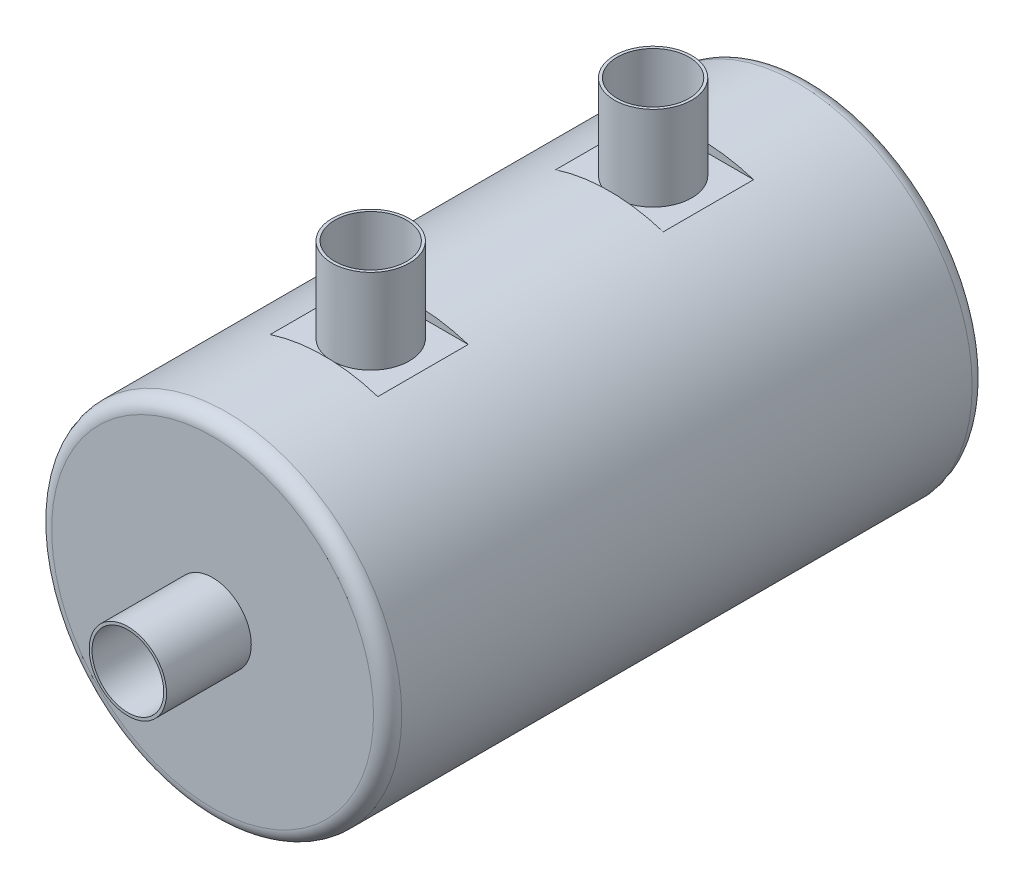
ISO-10303-21;
HEADER;
FILE_DESCRIPTION(('STEP AP214'),'2;1');
FILE_NAME('part.step','',(''),(''),'','','');
FILE_SCHEMA(('AUTOMOTIVE_DESIGN { 1 0 10303 214 1 1 1 1 }'));
ENDSEC;
DATA;
#1=APPLICATION_CONTEXT('core data for automotive mechanical design processes');
#2=APPLICATION_PROTOCOL_DEFINITION('international standard','automotive_design',2000,#1);
#3=PRODUCT_CONTEXT('',#1,'mechanical');
#4=PRODUCT('Part','Part','',(#3));
#5=PRODUCT_RELATED_PRODUCT_CATEGORY('part','',(#4));
#6=PRODUCT_DEFINITION_FORMATION('','',#4);
#7=PRODUCT_DEFINITION_CONTEXT('part definition',#1,'design');
#8=PRODUCT_DEFINITION('design','',#6,#7);
#9=PRODUCT_DEFINITION_SHAPE('','',#8);
#10=(LENGTH_UNIT() NAMED_UNIT(*) SI_UNIT(.MILLI.,.METRE.));
#11=(NAMED_UNIT(*) PLANE_ANGLE_UNIT() SI_UNIT($,.RADIAN.));
#12=(NAMED_UNIT(*) SI_UNIT($,.STERADIAN.) SOLID_ANGLE_UNIT());
#13=UNCERTAINTY_MEASURE_WITH_UNIT(LENGTH_MEASURE(1.E-05),#10,'distance_accuracy_value','');
#14=(GEOMETRIC_REPRESENTATION_CONTEXT(3) GLOBAL_UNCERTAINTY_ASSIGNED_CONTEXT((#13)) GLOBAL_UNIT_ASSIGNED_CONTEXT((#10,
#11,#12)) REPRESENTATION_CONTEXT('',''));
#15=CARTESIAN_POINT('',(0.,0.,0.));
#16=DIRECTION('',(0.,0.,1.));
#17=DIRECTION('',(1.,0.,0.));
#18=AXIS2_PLACEMENT_3D('',#15,#16,#17);
#19=CARTESIAN_POINT('',(0.,0.,-100.));
#20=DIRECTION('',(0.,0.,1.));
#21=DIRECTION('',(1.,0.,0.));
#22=AXIS2_PLACEMENT_3D('',#19,#20,#21);
#23=CYLINDRICAL_SURFACE('',#22,31.);
#24=CARTESIAN_POINT('',(0.,0.,-100.5));
#25=DIRECTION('',(0.,0.,-1.));
#26=DIRECTION('',(-1.,0.,0.));
#27=AXIS2_PLACEMENT_3D('',#24,#25,#26);
#28=CIRCLE('',#27,31.);
#29=CARTESIAN_POINT('',(-31.,0.,-100.5));
#30=VERTEX_POINT('',#29);
#31=EDGE_CURVE('E43',#30,#30,#28,.F.);
#32=ORIENTED_EDGE('',*,*,#31,.T.);
#33=EDGE_LOOP('',(#32));
#34=FACE_BOUND('',#33,.T.);
#35=CARTESIAN_POINT('',(0.,0.,0.5));
#36=DIRECTION('',(0.,0.,1.));
#37=DIRECTION('',(1.,0.,0.));
#38=AXIS2_PLACEMENT_3D('',#35,#36,#37);
#39=CIRCLE('',#38,31.);
#40=CARTESIAN_POINT('',(31.,0.,0.5));
#41=VERTEX_POINT('',#40);
#42=EDGE_CURVE('E236',#41,#41,#39,.F.);
#43=ORIENTED_EDGE('',*,*,#42,.T.);
#44=EDGE_LOOP('',(#43));
#45=FACE_BOUND('',#44,.T.);
#46=DIRECTION('',(0.,0.,1.));
#47=VECTOR('',#46,1.);
#48=CARTESIAN_POINT('',(-9.52627944162889,29.5,-100.));
#49=LINE('',#48,#47);
#50=CARTESIAN_POINT('',(-9.52627944162889,29.5,-32.7300887283543));
#51=VERTEX_POINT('',#50);
#52=CARTESIAN_POINT('',(-9.52627944162884,29.5,-16.7300887283543));
#53=VERTEX_POINT('',#52);
#54=EDGE_CURVE('E81',#51,#53,#49,.T.);
#55=ORIENTED_EDGE('',*,*,#54,.F.);
#56=CARTESIAN_POINT('',(0.,0.,-32.7300887283543));
#57=DIRECTION('',(0.,0.,1.));
#58=DIRECTION('',(1.,0.,0.));
#59=AXIS2_PLACEMENT_3D('',#56,#57,#58);
#60=CIRCLE('',#59,31.);
#61=CARTESIAN_POINT('',(9.52627944162889,29.5,-32.7300887283543));
#62=VERTEX_POINT('',#61);
#63=EDGE_CURVE('E112',#51,#62,#60,.F.);
#64=ORIENTED_EDGE('',*,*,#63,.T.);
#65=DIRECTION('',(0.,0.,1.));
#66=VECTOR('',#65,1.);
#67=CARTESIAN_POINT('',(9.52627944162889,29.5,-100.));
#68=LINE('',#67,#66);
#69=CARTESIAN_POINT('',(9.52627944162884,29.5,-16.7300887283543));
#70=VERTEX_POINT('',#69);
#71=EDGE_CURVE('E82',#70,#62,#68,.F.);
#72=ORIENTED_EDGE('',*,*,#71,.F.);
#73=CARTESIAN_POINT('',(0.,0.,-16.7300887283543));
#74=DIRECTION('',(0.,0.,1.));
#75=DIRECTION('',(1.,0.,0.));
#76=AXIS2_PLACEMENT_3D('',#73,#74,#75);
#77=CIRCLE('',#76,31.);
#78=EDGE_CURVE('E77',#53,#70,#77,.F.);
#79=ORIENTED_EDGE('',*,*,#78,.F.);
#80=EDGE_LOOP('',(#55,#64,#72,#79));
#81=FACE_BOUND('',#80,.T.);
#82=DIRECTION('',(0.,0.,1.));
#83=VECTOR('',#82,1.);
#84=CARTESIAN_POINT('',(-9.52627944162883,29.5,-100.));
#85=LINE('',#84,#83);
#86=CARTESIAN_POINT('',(-9.52627944162885,29.5,-67.2699112716457));
#87=VERTEX_POINT('',#86);
#88=CARTESIAN_POINT('',(-9.52627944162883,29.5,-83.2699112716457));
#89=VERTEX_POINT('',#88);
#90=EDGE_CURVE('E117',#87,#89,#85,.F.);
#91=ORIENTED_EDGE('',*,*,#90,.T.);
#92=CARTESIAN_POINT('',(0.,0.,-83.2699112716457));
#93=DIRECTION('',(0.,0.,1.));
#94=DIRECTION('',(1.,0.,0.));
#95=AXIS2_PLACEMENT_3D('',#92,#93,#94);
#96=CIRCLE('',#95,31.);
#97=CARTESIAN_POINT('',(9.52627944162883,29.5,-83.2699112716457));
#98=VERTEX_POINT('',#97);
#99=EDGE_CURVE('E56',#89,#98,#96,.F.);
#100=ORIENTED_EDGE('',*,*,#99,.T.);
#101=DIRECTION('',(0.,0.,1.));
#102=VECTOR('',#101,1.);
#103=CARTESIAN_POINT('',(9.52627944162883,29.5,-100.));
#104=LINE('',#103,#102);
#105=CARTESIAN_POINT('',(9.52627944162885,29.5,-67.2699112716457));
#106=VERTEX_POINT('',#105);
#107=EDGE_CURVE('E50',#98,#106,#104,.T.);
#108=ORIENTED_EDGE('',*,*,#107,.T.);
#109=CARTESIAN_POINT('',(0.,0.,-67.2699112716457));
#110=DIRECTION('',(0.,0.,1.));
#111=DIRECTION('',(1.,0.,0.));
#112=AXIS2_PLACEMENT_3D('',#109,#110,#111);
#113=CIRCLE('',#112,31.);
#114=EDGE_CURVE('E114',#87,#106,#113,.F.);
#115=ORIENTED_EDGE('',*,*,#114,.F.);
#116=EDGE_LOOP('',(#91,#100,#108,#115));
#117=FACE_BOUND('',#116,.T.);
#118=ADVANCED_FACE('F35',(#34,#45,#81,#117),#23,.T.);
#119=CARTESIAN_POINT('',(0.,0.,3.));
#120=DIRECTION('',(0.,0.,1.));
#121=DIRECTION('',(1.,0.,0.));
#122=AXIS2_PLACEMENT_3D('',#119,#120,#121);
#123=PLANE('',#122);
#124=CARTESIAN_POINT('',(0.,0.,3.));
#125=DIRECTION('',(0.,0.,1.));
#126=DIRECTION('',(1.,0.,0.));
#127=AXIS2_PLACEMENT_3D('',#124,#125,#126);
#128=CIRCLE('',#127,28.5);
#129=CARTESIAN_POINT('',(28.5,0.,3.));
#130=VERTEX_POINT('',#129);
#131=EDGE_CURVE('E11',#130,#130,#128,.T.);
#132=ORIENTED_EDGE('',*,*,#131,.T.);
#133=EDGE_LOOP('',(#132));
#134=FACE_BOUND('',#133,.T.);
#135=CARTESIAN_POINT('',(0.,0.,3.));
#136=DIRECTION('',(0.,0.,1.));
#137=DIRECTION('',(1.,0.,0.));
#138=AXIS2_PLACEMENT_3D('',#135,#136,#137);
#139=CIRCLE('',#138,6.85);
#140=CARTESIAN_POINT('',(6.85,0.,3.));
#141=VERTEX_POINT('',#140);
#142=EDGE_CURVE('E251',#141,#141,#139,.T.);
#143=ORIENTED_EDGE('',*,*,#142,.F.);
#144=EDGE_LOOP('',(#143));
#145=FACE_BOUND('',#144,.T.);
#146=ADVANCED_FACE('F196',(#134,#145),#123,.T.);
#147=CARTESIAN_POINT('',(0.,0.,-103.));
#148=DIRECTION('',(0.,0.,-1.));
#149=DIRECTION('',(-1.,0.,0.));
#150=AXIS2_PLACEMENT_3D('',#147,#148,#149);
#151=PLANE('',#150);
#152=CARTESIAN_POINT('',(0.,0.,-103.));
#153=DIRECTION('',(0.,0.,-1.));
#154=DIRECTION('',(-1.,0.,0.));
#155=AXIS2_PLACEMENT_3D('',#152,#153,#154);
#156=CIRCLE('',#155,28.5);
#157=CARTESIAN_POINT('',(-28.5,0.,-103.));
#158=VERTEX_POINT('',#157);
#159=EDGE_CURVE('E235',#158,#158,#156,.T.);
#160=ORIENTED_EDGE('',*,*,#159,.T.);
#161=EDGE_LOOP('',(#160));
#162=FACE_BOUND('',#161,.T.);
#163=CARTESIAN_POINT('',(0.,0.,-103.));
#164=DIRECTION('',(0.,0.,-1.));
#165=DIRECTION('',(-1.,0.,0.));
#166=AXIS2_PLACEMENT_3D('',#163,#164,#165);
#167=CIRCLE('',#166,6.85);
#168=CARTESIAN_POINT('',(-6.85,0.,-103.));
#169=VERTEX_POINT('',#168);
#170=EDGE_CURVE('E124',#169,#169,#167,.T.);
#171=ORIENTED_EDGE('',*,*,#170,.F.);
#172=EDGE_LOOP('',(#171));
#173=FACE_BOUND('',#172,.T.);
#174=ADVANCED_FACE('F187',(#162,#173),#151,.T.);
#175=CARTESIAN_POINT('',(-31.,0.,-32.7300887283543));
#176=DIRECTION('',(0.,0.,1.));
#177=DIRECTION('',(1.,0.,0.));
#178=AXIS2_PLACEMENT_3D('',#175,#176,#177);
#179=PLANE('',#178);
#180=DIRECTION('',(1.,0.,0.));
#181=VECTOR('',#180,1.);
#182=CARTESIAN_POINT('',(-31.,29.5,-32.7300887283543));
#183=LINE('',#182,#181);
#184=EDGE_CURVE('E93',#51,#62,#183,.T.);
#185=ORIENTED_EDGE('',*,*,#184,.T.);
#186=ORIENTED_EDGE('',*,*,#63,.F.);
#187=EDGE_LOOP('',(#185,#186));
#188=FACE_BOUND('',#187,.T.);
#189=ADVANCED_FACE('F184',(#188),#179,.T.);
#190=CARTESIAN_POINT('',(-31.,29.5,0.));
#191=DIRECTION('',(0.,-1.,0.));
#192=DIRECTION('',(0.,0.,-1.));
#193=AXIS2_PLACEMENT_3D('',#190,#191,#192);
#194=PLANE('',#193);
#195=CARTESIAN_POINT('',(0.,29.5,-25.));
#196=DIRECTION('',(0.,-1.,0.));
#197=DIRECTION('',(0.,0.,-1.));
#198=AXIS2_PLACEMENT_3D('',#195,#196,#197);
#199=CIRCLE('',#198,6.85);
#200=CARTESIAN_POINT('',(0.,29.5,-31.85));
#201=VERTEX_POINT('',#200);
#202=EDGE_CURVE('E121',#201,#201,#199,.F.);
#203=ORIENTED_EDGE('',*,*,#202,.F.);
#204=EDGE_LOOP('',(#203));
#205=FACE_BOUND('',#204,.T.);
#206=ORIENTED_EDGE('',*,*,#71,.T.);
#207=ORIENTED_EDGE('',*,*,#184,.F.);
#208=ORIENTED_EDGE('',*,*,#54,.T.);
#209=DIRECTION('',(1.,0.,0.));
#210=VECTOR('',#209,1.);
#211=CARTESIAN_POINT('',(-31.,29.5,-16.7300887283543));
#212=LINE('',#211,#210);
#213=EDGE_CURVE('E91',#53,#70,#212,.T.);
#214=ORIENTED_EDGE('',*,*,#213,.T.);
#215=EDGE_LOOP('',(#206,#207,#208,#214));
#216=FACE_BOUND('',#215,.T.);
#217=ADVANCED_FACE('F90',(#205,#216),#194,.F.);
#218=CARTESIAN_POINT('',(-31.,0.,-16.7300887283543));
#219=DIRECTION('',(0.,0.,1.));
#220=DIRECTION('',(1.,0.,0.));
#221=AXIS2_PLACEMENT_3D('',#218,#219,#220);
#222=PLANE('',#221);
#223=ORIENTED_EDGE('',*,*,#213,.F.);
#224=ORIENTED_EDGE('',*,*,#78,.T.);
#225=EDGE_LOOP('',(#223,#224));
#226=FACE_BOUND('',#225,.T.);
#227=ADVANCED_FACE('F95',(#226),#222,.F.);
#228=CARTESIAN_POINT('',(-31.,0.,-83.2699112716457));
#229=DIRECTION('',(0.,0.,1.));
#230=DIRECTION('',(1.,0.,0.));
#231=AXIS2_PLACEMENT_3D('',#228,#229,#230);
#232=PLANE('',#231);
#233=DIRECTION('',(1.,0.,0.));
#234=VECTOR('',#233,1.);
#235=CARTESIAN_POINT('',(-31.,29.5,-83.2699112716457));
#236=LINE('',#235,#234);
#237=EDGE_CURVE('E109',#89,#98,#236,.T.);
#238=ORIENTED_EDGE('',*,*,#237,.T.);
#239=ORIENTED_EDGE('',*,*,#99,.F.);
#240=EDGE_LOOP('',(#238,#239));
#241=FACE_BOUND('',#240,.T.);
#242=ADVANCED_FACE('F174',(#241),#232,.T.);
#243=CARTESIAN_POINT('',(-31.,29.5,0.));
#244=DIRECTION('',(0.,1.,0.));
#245=DIRECTION('',(0.,0.,1.));
#246=AXIS2_PLACEMENT_3D('',#243,#244,#245);
#247=PLANE('',#246);
#248=CARTESIAN_POINT('',(0.,29.5,-75.));
#249=DIRECTION('',(0.,1.,0.));
#250=DIRECTION('',(0.,0.,1.));
#251=AXIS2_PLACEMENT_3D('',#248,#249,#250);
#252=CIRCLE('',#251,6.85);
#253=CARTESIAN_POINT('',(0.,29.5,-68.15));
#254=VERTEX_POINT('',#253);
#255=EDGE_CURVE('E267',#254,#254,#252,.T.);
#256=ORIENTED_EDGE('',*,*,#255,.F.);
#257=EDGE_LOOP('',(#256));
#258=FACE_BOUND('',#257,.T.);
#259=DIRECTION('',(1.,0.,0.));
#260=VECTOR('',#259,1.);
#261=CARTESIAN_POINT('',(-31.,29.5,-67.2699112716457));
#262=LINE('',#261,#260);
#263=EDGE_CURVE('E98',#87,#106,#262,.T.);
#264=ORIENTED_EDGE('',*,*,#263,.T.);
#265=ORIENTED_EDGE('',*,*,#107,.F.);
#266=ORIENTED_EDGE('',*,*,#237,.F.);
#267=ORIENTED_EDGE('',*,*,#90,.F.);
#268=EDGE_LOOP('',(#264,#265,#266,#267));
#269=FACE_BOUND('',#268,.T.);
#270=ADVANCED_FACE('F177',(#258,#269),#247,.T.);
#271=CARTESIAN_POINT('',(-31.,0.,-67.2699112716457));
#272=DIRECTION('',(0.,0.,1.));
#273=DIRECTION('',(1.,0.,0.));
#274=AXIS2_PLACEMENT_3D('',#271,#272,#273);
#275=PLANE('',#274);
#276=ORIENTED_EDGE('',*,*,#263,.F.);
#277=ORIENTED_EDGE('',*,*,#114,.T.);
#278=EDGE_LOOP('',(#276,#277));
#279=FACE_BOUND('',#278,.T.);
#280=ADVANCED_FACE('F169',(#279),#275,.F.);
#281=CARTESIAN_POINT('',(0.,44.5,-25.));
#282=DIRECTION('',(0.,1.,0.));
#283=DIRECTION('',(0.,0.,1.));
#284=AXIS2_PLACEMENT_3D('',#281,#282,#283);
#285=PLANE('',#284);
#286=CARTESIAN_POINT('',(0.,44.5,-25.));
#287=DIRECTION('',(0.,1.,0.));
#288=DIRECTION('',(0.,0.,1.));
#289=AXIS2_PLACEMENT_3D('',#286,#287,#288);
#290=CIRCLE('',#289,6.85);
#291=CARTESIAN_POINT('',(0.,44.5,-18.15));
#292=VERTEX_POINT('',#291);
#293=EDGE_CURVE('E96',#292,#292,#290,.T.);
#294=ORIENTED_EDGE('',*,*,#293,.T.);
#295=EDGE_LOOP('',(#294));
#296=FACE_BOUND('',#295,.T.);
#297=CARTESIAN_POINT('',(0.,44.5,-25.));
#298=DIRECTION('',(0.,1.,0.));
#299=DIRECTION('',(0.,0.,1.));
#300=AXIS2_PLACEMENT_3D('',#297,#298,#299);
#301=CIRCLE('',#300,6.35);
#302=CARTESIAN_POINT('',(0.,44.5,-18.65));
#303=VERTEX_POINT('',#302);
#304=EDGE_CURVE('E101',#303,#303,#301,.T.);
#305=ORIENTED_EDGE('',*,*,#304,.F.);
#306=EDGE_LOOP('',(#305));
#307=FACE_BOUND('',#306,.T.);
#308=ADVANCED_FACE('F166',(#296,#307),#285,.T.);
#309=CARTESIAN_POINT('',(0.,44.5,-25.));
#310=DIRECTION('',(0.,-1.,0.));
#311=DIRECTION('',(0.,0.,-1.));
#312=AXIS2_PLACEMENT_3D('',#309,#310,#311);
#313=CYLINDRICAL_SURFACE('',#312,6.85);
#314=ORIENTED_EDGE('',*,*,#293,.F.);
#315=EDGE_LOOP('',(#314));
#316=FACE_BOUND('',#315,.T.);
#317=ORIENTED_EDGE('',*,*,#202,.T.);
#318=EDGE_LOOP('',(#317));
#319=FACE_BOUND('',#318,.T.);
#320=ADVANCED_FACE('F164',(#316,#319),#313,.T.);
#321=CARTESIAN_POINT('',(0.,44.5,-25.));
#322=DIRECTION('',(0.,-1.,0.));
#323=DIRECTION('',(0.,0.,-1.));
#324=AXIS2_PLACEMENT_3D('',#321,#322,#323);
#325=CYLINDRICAL_SURFACE('',#324,6.35);
#326=ORIENTED_EDGE('',*,*,#304,.T.);
#327=EDGE_LOOP('',(#326));
#328=FACE_BOUND('',#327,.T.);
#329=CARTESIAN_POINT('',(0.,28.,-18.65));
#330=CARTESIAN_POINT('',(0.175986127385621,28.0000024424553,-18.6499956540871));
#331=CARTESIAN_POINT('',(0.351921493153296,27.9983381630356,-18.6573175071976));
#332=CARTESIAN_POINT('',(0.702567132027708,27.9917328650277,-18.6865356173294));
#333=CARTESIAN_POINT('',(0.877277228705688,27.9867913839566,-18.7084339314016));
#334=CARTESIAN_POINT('',(1.22422588288912,27.9737633373598,-18.7666435265278));
#335=CARTESIAN_POINT('',(1.39646339404666,27.9656754787984,-18.8029607332989));
#336=CARTESIAN_POINT('',(1.73724262106718,27.9465761894508,-18.8897289751157));
#337=CARTESIAN_POINT('',(1.90578295194551,27.9355636826589,-18.9401852124221));
#338=CARTESIAN_POINT('',(2.23768148687968,27.9109375729308,-19.054744920799));
#339=CARTESIAN_POINT('',(2.401046958007,27.8973278250143,-19.1188281815325));
#340=CARTESIAN_POINT('',(2.72180725449148,27.8678617176012,-19.2602267311709));
#341=CARTESIAN_POINT('',(2.87919985053269,27.8520045295247,-19.3375469024181));
#342=CARTESIAN_POINT('',(3.18684430174427,27.8184823405264,-19.5048051219872));
#343=CARTESIAN_POINT('',(3.3370990089661,27.8008180707013,-19.5947380729372));
#344=CARTESIAN_POINT('',(3.62961307002988,27.7641432162039,-19.7866498325685));
#345=CARTESIAN_POINT('',(3.77186939882862,27.7451321282178,-19.8886331541555));
#346=CARTESIAN_POINT('',(4.04948558874383,27.7059851790748,-20.1055478860974));
#347=CARTESIAN_POINT('',(4.18470959091231,27.6858367037728,-20.2206509293078));
#348=CARTESIAN_POINT('',(4.44507131624075,27.6452294480879,-20.4617913703419));
#349=CARTESIAN_POINT('',(4.57020528059963,27.6247705554079,-20.5878328070291));
#350=CARTESIAN_POINT('',(4.80946697940778,27.5841213764205,-20.8499391945167));
#351=CARTESIAN_POINT('',(4.92359769365625,27.5639310186749,-20.986001413875));
#352=CARTESIAN_POINT('',(5.14015753337279,27.5243692885291,-21.2673328042956));
#353=CARTESIAN_POINT('',(5.24258232593044,27.504998221047,-21.4126053537982));
#354=CARTESIAN_POINT('',(5.43608669423084,27.4674133086096,-21.7130923443561));
#355=CARTESIAN_POINT('',(5.52702047529137,27.449215541772,-21.8684027586552));
#356=CARTESIAN_POINT('',(5.69548844081909,27.4147552736178,-22.1864064421749));
#357=CARTESIAN_POINT('',(5.77301757761592,27.3984935020368,-22.3491024635391));
#358=CARTESIAN_POINT('',(5.91400279612861,27.3684085006424,-22.6806304593824));
#359=CARTESIAN_POINT('',(5.97746551452543,27.3545841214746,-22.8494594962919));
#360=CARTESIAN_POINT('',(6.08987173319902,27.3297771869963,-23.1920847683122));
#361=CARTESIAN_POINT('',(6.13880999967146,27.3187956562718,-23.3658827692887));
#362=CARTESIAN_POINT('',(6.26172437814057,27.2909915422141,-23.8869933853279));
#363=CARTESIAN_POINT('',(6.31432610465363,27.2787505168291,-24.2399879893103));
#364=CARTESIAN_POINT('',(6.34840572928265,27.2708210488766,-24.771904554236));
#365=CARTESIAN_POINT('',(6.35228778451299,27.2699182764588,-24.9496848146028));
#366=CARTESIAN_POINT('',(6.34515920453633,27.2715782189895,-25.3049521026713));
#367=CARTESIAN_POINT('',(6.33414838144853,27.2741409776575,-25.4824391266455));
#368=CARTESIAN_POINT('',(6.27953964071084,27.2867929015038,-26.0054165707217));
#369=CARTESIAN_POINT('',(6.21481915445443,27.3017425123797,-26.3488210164901));
#370=CARTESIAN_POINT('',(6.03033647048368,27.3430757570479,-27.0195856905308));
#371=CARTESIAN_POINT('',(5.91057097783838,27.3694600753033,-27.3469449570588));
#372=CARTESIAN_POINT('',(5.61835125411965,27.4309409473964,-27.9797763488862));
#373=CARTESIAN_POINT('',(5.44545800500307,27.4661096190853,-28.2850388810494));
#374=CARTESIAN_POINT('',(5.05219952171485,27.5411552326439,-28.8626311218642));
#375=CARTESIAN_POINT('',(4.83182735910084,27.5810328612921,-29.1349560149686));
#376=CARTESIAN_POINT('',(4.34376958149265,27.6621427074177,-29.6456183164627));
#377=CARTESIAN_POINT('',(4.07510117071894,27.7033848372386,-29.8830159359653));
#378=CARTESIAN_POINT('',(3.50129126676188,27.7817327859305,-30.3095439796522));
#379=CARTESIAN_POINT('',(3.1961490132693,27.8188385185458,-30.4986733974123));
#380=CARTESIAN_POINT('',(2.55685867746273,27.8848678435702,-30.8235570863196));
#381=CARTESIAN_POINT('',(2.22264213876643,27.9137714029154,-30.9591809847432));
#382=CARTESIAN_POINT('',(1.535359783775,27.9599918641085,-31.1720770524521));
#383=CARTESIAN_POINT('',(1.182296928438,27.9773105803075,-31.2493583592612));
#384=CARTESIAN_POINT('',(0.475399502808541,27.9981492228286,-31.3419918768677));
#385=CARTESIAN_POINT('',(0.121741236051884,28.0019549456653,-31.3586269466822));
#386=CARTESIAN_POINT('',(-0.58330156656709,27.9961428976034,-31.3329829615933));
#387=CARTESIAN_POINT('',(-0.934686266979755,27.9865261093339,-31.290708219333));
#388=CARTESIAN_POINT('',(-1.6209058084874,27.9551306729822,-31.1495074510628));
#389=CARTESIAN_POINT('',(-1.95588774450323,27.9334979785049,-31.0512609366414));
#390=CARTESIAN_POINT('',(-2.60461379091722,27.8804951216384,-30.8016638395594));
#391=CARTESIAN_POINT('',(-2.91835599833118,27.8491240881406,-30.6503085060794));
#392=CARTESIAN_POINT('',(-3.52095109644635,27.7794238710292,-30.2961681989962));
#393=CARTESIAN_POINT('',(-3.80935448924766,27.7409963995272,-30.0926382422524));
#394=CARTESIAN_POINT('',(-4.34837653218561,27.6616337243811,-29.6408824251491));
#395=CARTESIAN_POINT('',(-4.59898987129981,27.6206981693851,-29.392650293073));
#396=CARTESIAN_POINT('',(-5.06042541220889,27.539937451294,-28.8526967446296));
#397=CARTESIAN_POINT('',(-5.2703558673263,27.500150632096,-28.5602077498299));
#398=CARTESIAN_POINT('',(-5.63817419183463,27.4271101044796,-27.9431738296425));
#399=CARTESIAN_POINT('',(-5.79606435953263,27.3938561075719,-27.6186303207333));
#400=CARTESIAN_POINT('',(-5.98974613210324,27.3519135560254,-27.116034672047));
#401=CARTESIAN_POINT('',(-6.0470286551816,27.3392765843631,-26.9462970638366));
#402=CARTESIAN_POINT('',(-6.14709124919259,27.3169530673522,-26.6024266222671));
#403=CARTESIAN_POINT('',(-6.1898767289168,27.3072654217586,-26.4282954542399));
#404=CARTESIAN_POINT('',(-6.26058594463114,27.2911409580452,-26.0768950008802));
#405=CARTESIAN_POINT('',(-6.28850891737839,27.2847043068764,-25.8996255548687));
#406=CARTESIAN_POINT('',(-6.32925831989709,27.2752805716779,-25.5432708192945));
#407=CARTESIAN_POINT('',(-6.34208538324858,27.272293342875,-25.3641856062583));
#408=CARTESIAN_POINT('',(-6.3524085113692,27.2698905599513,-25.0097694589585));
#409=CARTESIAN_POINT('',(-6.35025795563013,27.2703926781259,-24.8344492574774));
#410=CARTESIAN_POINT('',(-6.33147491951321,27.2747597306274,-24.4846313026691));
#411=CARTESIAN_POINT('',(-6.31484273873618,27.2786245953847,-24.3101335324023));
#412=CARTESIAN_POINT('',(-6.26723039492615,27.2896027503756,-23.9631830396764));
#413=CARTESIAN_POINT('',(-6.23624791482876,27.2967165651968,-23.7907306520877));
#414=CARTESIAN_POINT('',(-6.16019958163797,27.3139791772473,-23.4491806770672));
#415=CARTESIAN_POINT('',(-6.11513871833993,27.3241268991155,-23.2800819235558));
#416=CARTESIAN_POINT('',(-6.0114781953646,27.3471193121401,-22.9469666271077));
#417=CARTESIAN_POINT('',(-5.95292920882752,27.3599538930394,-22.7829336052529));
#418=CARTESIAN_POINT('',(-5.82266739713263,27.387971406276,-22.4604578784916));
#419=CARTESIAN_POINT('',(-5.75095918077107,27.4031535161392,-22.30201323944));
#420=CARTESIAN_POINT('',(-5.59485214810497,27.4354511836296,-21.9916249339789));
#421=CARTESIAN_POINT('',(-5.51044782683445,27.4525675791485,-21.8396841244881));
#422=CARTESIAN_POINT('',(-5.32959222865659,27.4882508676183,-21.5434033327962));
#423=CARTESIAN_POINT('',(-5.23314499243775,27.5068172732769,-21.3990608241664));
#424=CARTESIAN_POINT('',(-5.02657473943241,27.5453230674901,-21.1157427456979));
#425=CARTESIAN_POINT('',(-4.91619711016069,27.5652837006029,-20.976955639789));
#426=CARTESIAN_POINT('',(-4.68430325556802,27.6056361098705,-20.7091768648312));
#427=CARTESIAN_POINT('',(-4.56279089228346,27.6260277346636,-20.5801818276144));
#428=CARTESIAN_POINT('',(-4.30932785870548,27.6666979068756,-20.3327114337953));
#429=CARTESIAN_POINT('',(-4.1773710680875,27.6869763804269,-20.2142423328768));
#430=CARTESIAN_POINT('',(-3.90400239411823,27.7268432223613,-19.9887477677634));
#431=CARTESIAN_POINT('',(-3.76259399133732,27.7464318407712,-19.8817181282967));
#432=CARTESIAN_POINT('',(-3.46908027654679,27.7846665788437,-19.6783156885166));
#433=CARTESIAN_POINT('',(-3.31684898751155,27.8032947752476,-19.5821211766161));
#434=CARTESIAN_POINT('',(-3.00466855013638,27.8387614055352,-19.4029609379099));
#435=CARTESIAN_POINT('',(-2.84472227251609,27.8556004977814,-19.3199903392489));
#436=CARTESIAN_POINT('',(-2.51824931841381,27.8870091997847,-19.1679057811486));
#437=CARTESIAN_POINT('',(-2.35172610476925,27.9015799843785,-19.0987846432222));
#438=CARTESIAN_POINT('',(-2.0132711702554,27.9280429659653,-18.9749083515643));
#439=CARTESIAN_POINT('',(-1.84134038359391,27.939935622764,-18.920150731505));
#440=CARTESIAN_POINT('',(-1.39631115303161,27.9664762637892,-18.7990662979703));
#441=CARTESIAN_POINT('',(-1.12014687936027,27.9789758793189,-18.7432528545169));
#442=CARTESIAN_POINT('',(-0.562611680249285,27.9957355860825,-18.6687241223366));
#443=CARTESIAN_POINT('',(-0.281241020588077,27.9999960967456,-18.6500069451439));
#444=CARTESIAN_POINT('',(0.,28.,-18.65));
#445=B_SPLINE_CURVE_WITH_KNOTS('',3,(#329,#330,#331,#332,#333,#334,#335,#336,#337,#338,#339,
#340,#341,#342,#343,#344,#345,#346,#347,#348,#349,#350,#351,#352,#353,#354,#355,#356,#357,#358,
#359,#360,#361,#362,#363,#364,#365,#366,#367,#368,#369,#370,#371,#372,#373,#374,#375,#376,#377,
#378,#379,#380,#381,#382,#383,#384,#385,#386,#387,#388,#389,#390,#391,#392,#393,#394,#395,#396,
#397,#398,#399,#400,#401,#402,#403,#404,#405,#406,#407,#408,#409,#410,#411,#412,#413,#414,#415,
#416,#417,#418,#419,#420,#421,#422,#423,#424,#425,#426,#427,#428,#429,#430,#431,#432,#433,#434,
#435,#436,#437,#438,#439,#440,#441,#442,#443,#444),.UNSPECIFIED.,.T.,.F.,(4,2,2,2,2,2,2,2,2,2,2,
2,2,2,2,2,2,2,2,2,2,2,2,2,2,2,2,2,2,2,2,2,2,2,2,2,2,2,2,2,2,2,2,2,2,2,2,2,2,2,2,2,2,2,2,2,2,4),
(0.,0.527710992134985,1.05549647138514,1.58349907896331,2.11169621345461,2.63911537156383,
3.16672948534267,3.69413097854249,4.22173061520906,4.75726334222079,5.29299465615149,
5.82858047829724,6.36436390816322,6.90637834908343,7.44859644924103,7.99055817817078,
8.53271496350044,9.59776683200737,10.1307135201814,10.6636669317962,11.7076292591981,
12.751654085128,13.8045493465792,14.8575983577804,15.935184268939,17.012792646648,
18.0930107669528,19.1730596700996,20.2301250626469,21.2871130740905,22.3315343898524,
23.3760491575629,24.4364008904322,25.496901506752,26.5785200990191,27.6600909162835,
28.1983097957211,28.7363276460621,29.2743731228789,29.8123960169535,30.337768623209,
30.8631303606344,31.3885769549343,31.9138375262868,32.4371560454768,32.9602916298547,
33.4836547004961,34.0068426396937,34.5415643417219,35.0761012747232,35.6109537933407,
36.1456104254651,36.6880685488576,37.2303263596092,37.7723023746857,38.3141852672486,
39.157555913121,40.0008836242785),.UNSPECIFIED.);
#446=CARTESIAN_POINT('',(0.,28.,-18.65));
#447=VERTEX_POINT('',#446);
#448=EDGE_CURVE('E133',#447,#447,#445,.T.);
#449=ORIENTED_EDGE('',*,*,#448,.F.);
#450=EDGE_LOOP('',(#449));
#451=FACE_BOUND('',#450,.T.);
#452=ADVANCED_FACE('F157',(#328,#451),#325,.F.);
#453=CARTESIAN_POINT('',(0.,44.5,-75.));
#454=DIRECTION('',(0.,1.,0.));
#455=DIRECTION('',(0.,0.,1.));
#456=AXIS2_PLACEMENT_3D('',#453,#454,#455);
#457=PLANE('',#456);
#458=CARTESIAN_POINT('',(0.,44.5,-75.));
#459=DIRECTION('',(0.,1.,0.));
#460=DIRECTION('',(0.,0.,1.));
#461=AXIS2_PLACEMENT_3D('',#458,#459,#460);
#462=CIRCLE('',#461,6.85);
#463=CARTESIAN_POINT('',(0.,44.5,-68.15));
#464=VERTEX_POINT('',#463);
#465=EDGE_CURVE('E268',#464,#464,#462,.T.);
#466=ORIENTED_EDGE('',*,*,#465,.T.);
#467=EDGE_LOOP('',(#466));
#468=FACE_BOUND('',#467,.T.);
#469=CARTESIAN_POINT('',(0.,44.5,-75.));
#470=DIRECTION('',(0.,1.,0.));
#471=DIRECTION('',(0.,0.,1.));
#472=AXIS2_PLACEMENT_3D('',#469,#470,#471);
#473=CIRCLE('',#472,6.35);
#474=CARTESIAN_POINT('',(0.,44.5,-68.65));
#475=VERTEX_POINT('',#474);
#476=EDGE_CURVE('E264',#475,#475,#473,.T.);
#477=ORIENTED_EDGE('',*,*,#476,.F.);
#478=EDGE_LOOP('',(#477));
#479=FACE_BOUND('',#478,.T.);
#480=ADVANCED_FACE('F154',(#468,#479),#457,.T.);
#481=CARTESIAN_POINT('',(0.,44.5,-75.));
#482=DIRECTION('',(0.,-1.,0.));
#483=DIRECTION('',(0.,0.,-1.));
#484=AXIS2_PLACEMENT_3D('',#481,#482,#483);
#485=CYLINDRICAL_SURFACE('',#484,6.85);
#486=ORIENTED_EDGE('',*,*,#465,.F.);
#487=EDGE_LOOP('',(#486));
#488=FACE_BOUND('',#487,.T.);
#489=ORIENTED_EDGE('',*,*,#255,.T.);
#490=EDGE_LOOP('',(#489));
#491=FACE_BOUND('',#490,.T.);
#492=ADVANCED_FACE('F152',(#488,#491),#485,.T.);
#493=CARTESIAN_POINT('',(0.,44.5,-75.));
#494=DIRECTION('',(0.,-1.,0.));
#495=DIRECTION('',(0.,0.,-1.));
#496=AXIS2_PLACEMENT_3D('',#493,#494,#495);
#497=CYLINDRICAL_SURFACE('',#496,6.35);
#498=ORIENTED_EDGE('',*,*,#476,.T.);
#499=EDGE_LOOP('',(#498));
#500=FACE_BOUND('',#499,.T.);
#501=CARTESIAN_POINT('',(0.,28.,-68.65));
#502=CARTESIAN_POINT('',(0.175986127385621,28.0000024424553,-68.6499956540871));
#503=CARTESIAN_POINT('',(0.351921493153296,27.9983381630356,-68.6573175071976));
#504=CARTESIAN_POINT('',(0.702567132027708,27.9917328650277,-68.6865356173294));
#505=CARTESIAN_POINT('',(0.877277228705688,27.9867913839566,-68.7084339314016));
#506=CARTESIAN_POINT('',(1.22422588288912,27.9737633373598,-68.7666435265278));
#507=CARTESIAN_POINT('',(1.39646339404666,27.9656754787984,-68.8029607332989));
#508=CARTESIAN_POINT('',(1.73724262106718,27.9465761894508,-68.8897289751157));
#509=CARTESIAN_POINT('',(1.90578295194551,27.9355636826589,-68.9401852124222));
#510=CARTESIAN_POINT('',(2.23768148687968,27.9109375729308,-69.054744920799));
#511=CARTESIAN_POINT('',(2.401046958007,27.8973278250143,-69.1188281815325));
#512=CARTESIAN_POINT('',(2.72180725449148,27.8678617176012,-69.2602267311709));
#513=CARTESIAN_POINT('',(2.87919985053268,27.8520045295247,-69.3375469024181));
#514=CARTESIAN_POINT('',(3.18684430174426,27.8184823405264,-69.5048051219872));
#515=CARTESIAN_POINT('',(3.3370990089661,27.8008180707013,-69.5947380729373));
#516=CARTESIAN_POINT('',(3.62961307002988,27.7641432162039,-69.7866498325685));
#517=CARTESIAN_POINT('',(3.77186939882862,27.7451321282178,-69.8886331541555));
#518=CARTESIAN_POINT('',(4.04948558874383,27.7059851790748,-70.1055478860974));
#519=CARTESIAN_POINT('',(4.1847095909123,27.6858367037728,-70.2206509293078));
#520=CARTESIAN_POINT('',(4.44507131624074,27.6452294480879,-70.4617913703419));
#521=CARTESIAN_POINT('',(4.57020528059962,27.6247705554079,-70.5878328070291));
#522=CARTESIAN_POINT('',(4.80946697940778,27.5841213764205,-70.8499391945168));
#523=CARTESIAN_POINT('',(4.92359769365625,27.5639310186749,-70.986001413875));
#524=CARTESIAN_POINT('',(5.14015753337279,27.5243692885291,-71.2673328042956));
#525=CARTESIAN_POINT('',(5.24258232593044,27.504998221047,-71.4126053537982));
#526=CARTESIAN_POINT('',(5.43608669423084,27.4674133086096,-71.7130923443561));
#527=CARTESIAN_POINT('',(5.52702047529136,27.449215541772,-71.8684027586553));
#528=CARTESIAN_POINT('',(5.69548844081909,27.4147552736178,-72.1864064421749));
#529=CARTESIAN_POINT('',(5.77301757761591,27.3984935020368,-72.3491024635392));
#530=CARTESIAN_POINT('',(5.9140027961286,27.3684085006424,-72.6806304593824));
#531=CARTESIAN_POINT('',(5.97746551452543,27.3545841214746,-72.8494594962919));
#532=CARTESIAN_POINT('',(6.08987173319902,27.3297771869963,-73.1920847683122));
#533=CARTESIAN_POINT('',(6.13880999967146,27.3187956562718,-73.3658827692887));
#534=CARTESIAN_POINT('',(6.26172437814056,27.2909915422141,-73.8869933853279));
#535=CARTESIAN_POINT('',(6.31432610465363,27.2787505168291,-74.2399879893103));
#536=CARTESIAN_POINT('',(6.34840572928264,27.2708210488766,-74.771904554236));
#537=CARTESIAN_POINT('',(6.35228778451299,27.2699182764588,-74.9496848146028));
#538=CARTESIAN_POINT('',(6.34515920453633,27.2715782189895,-75.3049521026714));
#539=CARTESIAN_POINT('',(6.33414838144853,27.2741409776575,-75.4824391266455));
#540=CARTESIAN_POINT('',(6.27953964071083,27.2867929015038,-76.0054165707217));
#541=CARTESIAN_POINT('',(6.21481915445443,27.3017425123797,-76.3488210164901));
#542=CARTESIAN_POINT('',(6.03033647048368,27.3430757570479,-77.0195856905308));
#543=CARTESIAN_POINT('',(5.91057097783837,27.3694600753033,-77.3469449570588));
#544=CARTESIAN_POINT('',(5.61835125411965,27.4309409473964,-77.9797763488862));
#545=CARTESIAN_POINT('',(5.44545800500306,27.4661096190853,-78.2850388810494));
#546=CARTESIAN_POINT('',(5.05219952171484,27.5411552326439,-78.8626311218642));
#547=CARTESIAN_POINT('',(4.83182735910084,27.5810328612921,-79.1349560149686));
#548=CARTESIAN_POINT('',(4.34376958149264,27.6621427074177,-79.6456183164627));
#549=CARTESIAN_POINT('',(4.07510117071893,27.7033848372386,-79.8830159359653));
#550=CARTESIAN_POINT('',(3.50129126676187,27.7817327859305,-80.3095439796522));
#551=CARTESIAN_POINT('',(3.1961490132693,27.8188385185458,-80.4986733974123));
#552=CARTESIAN_POINT('',(2.55685867746273,27.8848678435702,-80.8235570863196));
#553=CARTESIAN_POINT('',(2.22264213876642,27.9137714029154,-80.9591809847432));
#554=CARTESIAN_POINT('',(1.535359783775,27.9599918641085,-81.1720770524522));
#555=CARTESIAN_POINT('',(1.18229692843799,27.9773105803075,-81.2493583592613));
#556=CARTESIAN_POINT('',(0.475399502808535,27.9981492228286,-81.3419918768677));
#557=CARTESIAN_POINT('',(0.121741236051879,28.0019549456653,-81.3586269466822));
#558=CARTESIAN_POINT('',(-0.583301566567093,27.9961428976034,-81.3329829615933));
#559=CARTESIAN_POINT('',(-0.934686266979758,27.9865261093339,-81.290708219333));
#560=CARTESIAN_POINT('',(-1.6209058084874,27.9551306729822,-81.1495074510628));
#561=CARTESIAN_POINT('',(-1.95588774450323,27.9334979785049,-81.0512609366414));
#562=CARTESIAN_POINT('',(-2.60461379091722,27.8804951216384,-80.8016638395594));
#563=CARTESIAN_POINT('',(-2.91835599833118,27.8491240881405,-80.6503085060794));
#564=CARTESIAN_POINT('',(-3.52095109644635,27.7794238710292,-80.2961681989962));
#565=CARTESIAN_POINT('',(-3.80935448924766,27.7409963995272,-80.0926382422524));
#566=CARTESIAN_POINT('',(-4.34837653218561,27.6616337243811,-79.6408824251491));
#567=CARTESIAN_POINT('',(-4.59898987129981,27.6206981693851,-79.392650293073));
#568=CARTESIAN_POINT('',(-5.06042541220889,27.539937451294,-78.8526967446296));
#569=CARTESIAN_POINT('',(-5.27035586732631,27.500150632096,-78.5602077498299));
#570=CARTESIAN_POINT('',(-5.63817419183463,27.4271101044796,-77.9431738296425));
#571=CARTESIAN_POINT('',(-5.79606435953263,27.3938561075719,-77.6186303207333));
#572=CARTESIAN_POINT('',(-5.98974613210324,27.3519135560254,-77.116034672047));
#573=CARTESIAN_POINT('',(-6.0470286551816,27.3392765843631,-76.9462970638366));
#574=CARTESIAN_POINT('',(-6.14709124919259,27.3169530673522,-76.6024266222671));
#575=CARTESIAN_POINT('',(-6.1898767289168,27.3072654217586,-76.4282954542399));
#576=CARTESIAN_POINT('',(-6.26058594463114,27.2911409580452,-76.0768950008802));
#577=CARTESIAN_POINT('',(-6.28850891737839,27.2847043068764,-75.8996255548687));
#578=CARTESIAN_POINT('',(-6.32925831989709,27.2752805716779,-75.5432708192945));
#579=CARTESIAN_POINT('',(-6.34208538324858,27.272293342875,-75.3641856062583));
#580=CARTESIAN_POINT('',(-6.3524085113692,27.2698905599513,-75.0097694589585));
#581=CARTESIAN_POINT('',(-6.35025795563013,27.2703926781259,-74.8344492574774));
#582=CARTESIAN_POINT('',(-6.33147491951321,27.2747597306274,-74.4846313026691));
#583=CARTESIAN_POINT('',(-6.31484273873618,27.2786245953847,-74.3101335324023));
#584=CARTESIAN_POINT('',(-6.26723039492614,27.2896027503756,-73.9631830396764));
#585=CARTESIAN_POINT('',(-6.23624791482876,27.2967165651968,-73.7907306520877));
#586=CARTESIAN_POINT('',(-6.16019958163797,27.3139791772473,-73.4491806770672));
#587=CARTESIAN_POINT('',(-6.11513871833992,27.3241268991155,-73.2800819235558));
#588=CARTESIAN_POINT('',(-6.0114781953646,27.3471193121401,-72.9469666271077));
#589=CARTESIAN_POINT('',(-5.95292920882752,27.3599538930394,-72.7829336052529));
#590=CARTESIAN_POINT('',(-5.82266739713263,27.387971406276,-72.4604578784916));
#591=CARTESIAN_POINT('',(-5.75095918077106,27.4031535161392,-72.30201323944));
#592=CARTESIAN_POINT('',(-5.59485214810496,27.4354511836296,-71.9916249339789));
#593=CARTESIAN_POINT('',(-5.51044782683444,27.4525675791485,-71.8396841244881));
#594=CARTESIAN_POINT('',(-5.32959222865658,27.4882508676183,-71.5434033327962));
#595=CARTESIAN_POINT('',(-5.23314499243774,27.5068172732769,-71.3990608241664));
#596=CARTESIAN_POINT('',(-5.0265747394324,27.5453230674901,-71.1157427456979));
#597=CARTESIAN_POINT('',(-4.91619711016067,27.5652837006029,-70.976955639789));
#598=CARTESIAN_POINT('',(-4.684303255568,27.6056361098705,-70.7091768648312));
#599=CARTESIAN_POINT('',(-4.56279089228345,27.6260277346636,-70.5801818276144));
#600=CARTESIAN_POINT('',(-4.30932785870547,27.6666979068756,-70.3327114337953));
#601=CARTESIAN_POINT('',(-4.17737106808749,27.6869763804269,-70.2142423328768));
#602=CARTESIAN_POINT('',(-3.90400239411823,27.7268432223613,-69.9887477677634));
#603=CARTESIAN_POINT('',(-3.76259399133732,27.7464318407712,-69.8817181282967));
#604=CARTESIAN_POINT('',(-3.4690802765468,27.7846665788437,-69.6783156885166));
#605=CARTESIAN_POINT('',(-3.31684898751156,27.8032947752476,-69.5821211766161));
#606=CARTESIAN_POINT('',(-3.00466855013639,27.8387614055352,-69.4029609379099));
#607=CARTESIAN_POINT('',(-2.8447222725161,27.8556004977814,-69.3199903392489));
#608=CARTESIAN_POINT('',(-2.51824931841382,27.8870091997847,-69.1679057811487));
#609=CARTESIAN_POINT('',(-2.35172610476925,27.9015799843785,-69.0987846432222));
#610=CARTESIAN_POINT('',(-2.0132711702554,27.9280429659653,-68.9749083515643));
#611=CARTESIAN_POINT('',(-1.84134038359391,27.939935622764,-68.920150731505));
#612=CARTESIAN_POINT('',(-1.39631115303161,27.9664762637892,-68.7990662979704));
#613=CARTESIAN_POINT('',(-1.12014687936027,27.9789758793189,-68.7432528545169));
#614=CARTESIAN_POINT('',(-0.562611680249284,27.9957355860825,-68.6687241223366));
#615=CARTESIAN_POINT('',(-0.281241020588077,27.9999960967456,-68.6500069451439));
#616=CARTESIAN_POINT('',(0.,28.,-68.65));
#617=B_SPLINE_CURVE_WITH_KNOTS('',3,(#501,#502,#503,#504,#505,#506,#507,#508,#509,#510,#511,
#512,#513,#514,#515,#516,#517,#518,#519,#520,#521,#522,#523,#524,#525,#526,#527,#528,#529,#530,
#531,#532,#533,#534,#535,#536,#537,#538,#539,#540,#541,#542,#543,#544,#545,#546,#547,#548,#549,
#550,#551,#552,#553,#554,#555,#556,#557,#558,#559,#560,#561,#562,#563,#564,#565,#566,#567,#568,
#569,#570,#571,#572,#573,#574,#575,#576,#577,#578,#579,#580,#581,#582,#583,#584,#585,#586,#587,
#588,#589,#590,#591,#592,#593,#594,#595,#596,#597,#598,#599,#600,#601,#602,#603,#604,#605,#606,
#607,#608,#609,#610,#611,#612,#613,#614,#615,#616),.UNSPECIFIED.,.T.,.F.,(4,2,2,2,2,2,2,2,2,2,2,
2,2,2,2,2,2,2,2,2,2,2,2,2,2,2,2,2,2,2,2,2,2,2,2,2,2,2,2,2,2,2,2,2,2,2,2,2,2,2,2,2,2,2,2,2,2,4),
(0.,0.527710992134985,1.05549647138514,1.58349907896331,2.11169621345461,2.63911537156382,
3.16672948534267,3.69413097854248,4.22173061520905,4.75726334222079,5.29299465615149,
5.82858047829725,6.36436390816321,6.90637834908341,7.44859644924102,7.99055817817077,
8.53271496350043,9.59776683200736,10.1307135201814,10.6636669317962,11.7076292591981,
12.751654085128,13.8045493465792,14.8575983577804,15.935184268939,17.012792646648,
18.0930107669528,19.1730596700996,20.2301250626469,21.2871130740904,22.3315343898524,
23.3760491575629,24.4364008904321,25.496901506752,26.5785200990191,27.6600909162835,
28.1983097957211,28.736327646062,29.2743731228789,29.8123960169534,30.337768623209,
30.8631303606344,31.3885769549343,31.9138375262868,32.4371560454768,32.9602916298547,
33.4836547004961,34.0068426396937,34.5415643417219,35.0761012747232,35.6109537933407,
36.1456104254651,36.6880685488576,37.2303263596092,37.7723023746857,38.3141852672486,
39.157555913121,40.0008836242785),.UNSPECIFIED.);
#618=CARTESIAN_POINT('',(0.,28.,-68.65));
#619=VERTEX_POINT('',#618);
#620=EDGE_CURVE('E125',#619,#619,#617,.T.);
#621=ORIENTED_EDGE('',*,*,#620,.F.);
#622=EDGE_LOOP('',(#621));
#623=FACE_BOUND('',#622,.T.);
#624=ADVANCED_FACE('F148',(#500,#623),#497,.F.);
#625=CARTESIAN_POINT('',(0.,0.,-100.));
#626=DIRECTION('',(0.,0.,-1.));
#627=DIRECTION('',(-1.,0.,0.));
#628=AXIS2_PLACEMENT_3D('',#625,#626,#627);
#629=PLANE('',#628);
#630=CARTESIAN_POINT('',(0.,0.,-100.));
#631=DIRECTION('',(0.,0.,-1.));
#632=DIRECTION('',(-1.,0.,0.));
#633=AXIS2_PLACEMENT_3D('',#630,#631,#632);
#634=CIRCLE('',#633,6.35);
#635=CARTESIAN_POINT('',(-6.35,0.,-100.));
#636=VERTEX_POINT('',#635);
#637=EDGE_CURVE('E243',#636,#636,#634,.F.);
#638=ORIENTED_EDGE('',*,*,#637,.F.);
#639=EDGE_LOOP('',(#638));
#640=FACE_BOUND('',#639,.T.);
#641=CARTESIAN_POINT('',(0.,0.,-100.));
#642=DIRECTION('',(0.,0.,1.));
#643=DIRECTION('',(1.,0.,0.));
#644=AXIS2_PLACEMENT_3D('',#641,#642,#643);
#645=CIRCLE('',#644,28.);
#646=CARTESIAN_POINT('',(28.,0.,-100.));
#647=VERTEX_POINT('',#646);
#648=EDGE_CURVE('E86',#647,#647,#645,.T.);
#649=ORIENTED_EDGE('',*,*,#648,.T.);
#650=EDGE_LOOP('',(#649));
#651=FACE_BOUND('',#650,.T.);
#652=ADVANCED_FACE('F151',(#640,#651),#629,.F.);
#653=CARTESIAN_POINT('',(0.,0.,0.));
#654=DIRECTION('',(0.,0.,1.));
#655=DIRECTION('',(1.,0.,0.));
#656=AXIS2_PLACEMENT_3D('',#653,#654,#655);
#657=PLANE('',#656);
#658=CARTESIAN_POINT('',(0.,0.,0.));
#659=DIRECTION('',(0.,0.,1.));
#660=DIRECTION('',(1.,0.,0.));
#661=AXIS2_PLACEMENT_3D('',#658,#659,#660);
#662=CIRCLE('',#661,6.35);
#663=CARTESIAN_POINT('',(6.35,0.,0.));
#664=VERTEX_POINT('',#663);
#665=EDGE_CURVE('E246',#664,#664,#662,.T.);
#666=ORIENTED_EDGE('',*,*,#665,.T.);
#667=EDGE_LOOP('',(#666));
#668=FACE_BOUND('',#667,.T.);
#669=CARTESIAN_POINT('',(0.,0.,0.));
#670=DIRECTION('',(0.,0.,1.));
#671=DIRECTION('',(1.,0.,0.));
#672=AXIS2_PLACEMENT_3D('',#669,#670,#671);
#673=CIRCLE('',#672,28.);
#674=CARTESIAN_POINT('',(28.,0.,0.));
#675=VERTEX_POINT('',#674);
#676=EDGE_CURVE('E107',#675,#675,#673,.T.);
#677=ORIENTED_EDGE('',*,*,#676,.F.);
#678=EDGE_LOOP('',(#677));
#679=FACE_BOUND('',#678,.T.);
#680=ADVANCED_FACE('F200',(#668,#679),#657,.F.);
#681=CARTESIAN_POINT('',(0.,0.,-100.));
#682=DIRECTION('',(0.,0.,1.));
#683=DIRECTION('',(1.,0.,0.));
#684=AXIS2_PLACEMENT_3D('',#681,#682,#683);
#685=CYLINDRICAL_SURFACE('',#684,28.);
#686=ORIENTED_EDGE('',*,*,#448,.T.);
#687=EDGE_LOOP('',(#686));
#688=FACE_BOUND('',#687,.T.);
#689=ORIENTED_EDGE('',*,*,#620,.T.);
#690=EDGE_LOOP('',(#689));
#691=FACE_BOUND('',#690,.T.);
#692=ORIENTED_EDGE('',*,*,#648,.F.);
#693=EDGE_LOOP('',(#692));
#694=FACE_BOUND('',#693,.T.);
#695=ORIENTED_EDGE('',*,*,#676,.T.);
#696=EDGE_LOOP('',(#695));
#697=FACE_BOUND('',#696,.T.);
#698=ADVANCED_FACE('F140',(#688,#691,#694,#697),#685,.F.);
#699=CARTESIAN_POINT('',(0.,0.,18.));
#700=DIRECTION('',(0.,0.,1.));
#701=DIRECTION('',(1.,0.,0.));
#702=AXIS2_PLACEMENT_3D('',#699,#700,#701);
#703=PLANE('',#702);
#704=CARTESIAN_POINT('',(0.,0.,18.));
#705=DIRECTION('',(0.,0.,1.));
#706=DIRECTION('',(1.,0.,0.));
#707=AXIS2_PLACEMENT_3D('',#704,#705,#706);
#708=CIRCLE('',#707,6.85);
#709=CARTESIAN_POINT('',(6.85,0.,18.));
#710=VERTEX_POINT('',#709);
#711=EDGE_CURVE('E134',#710,#710,#708,.T.);
#712=ORIENTED_EDGE('',*,*,#711,.T.);
#713=EDGE_LOOP('',(#712));
#714=FACE_BOUND('',#713,.T.);
#715=CARTESIAN_POINT('',(0.,0.,18.));
#716=DIRECTION('',(0.,0.,1.));
#717=DIRECTION('',(1.,0.,0.));
#718=AXIS2_PLACEMENT_3D('',#715,#716,#717);
#719=CIRCLE('',#718,6.35);
#720=CARTESIAN_POINT('',(6.35,0.,18.));
#721=VERTEX_POINT('',#720);
#722=EDGE_CURVE('E247',#721,#721,#719,.T.);
#723=ORIENTED_EDGE('',*,*,#722,.F.);
#724=EDGE_LOOP('',(#723));
#725=FACE_BOUND('',#724,.T.);
#726=ADVANCED_FACE('F209',(#714,#725),#703,.T.);
#727=CARTESIAN_POINT('',(0.,0.,18.));
#728=DIRECTION('',(0.,0.,-1.));
#729=DIRECTION('',(-1.,0.,0.));
#730=AXIS2_PLACEMENT_3D('',#727,#728,#729);
#731=CYLINDRICAL_SURFACE('',#730,6.85);
#732=ORIENTED_EDGE('',*,*,#711,.F.);
#733=EDGE_LOOP('',(#732));
#734=FACE_BOUND('',#733,.T.);
#735=ORIENTED_EDGE('',*,*,#142,.T.);
#736=EDGE_LOOP('',(#735));
#737=FACE_BOUND('',#736,.T.);
#738=ADVANCED_FACE('F297',(#734,#737),#731,.T.);
#739=CARTESIAN_POINT('',(0.,0.,18.));
#740=DIRECTION('',(0.,0.,-1.));
#741=DIRECTION('',(-1.,0.,0.));
#742=AXIS2_PLACEMENT_3D('',#739,#740,#741);
#743=CYLINDRICAL_SURFACE('',#742,6.35);
#744=ORIENTED_EDGE('',*,*,#722,.T.);
#745=EDGE_LOOP('',(#744));
#746=FACE_BOUND('',#745,.T.);
#747=ORIENTED_EDGE('',*,*,#665,.F.);
#748=EDGE_LOOP('',(#747));
#749=FACE_BOUND('',#748,.T.);
#750=ADVANCED_FACE('F300',(#746,#749),#743,.F.);
#751=CARTESIAN_POINT('',(0.,0.,-118.));
#752=DIRECTION('',(0.,0.,1.));
#753=DIRECTION('',(1.,0.,0.));
#754=AXIS2_PLACEMENT_3D('',#751,#752,#753);
#755=CYLINDRICAL_SURFACE('',#754,6.85);
#756=CARTESIAN_POINT('',(0.,0.,-118.));
#757=DIRECTION('',(0.,0.,1.));
#758=DIRECTION('',(1.,0.,0.));
#759=AXIS2_PLACEMENT_3D('',#756,#757,#758);
#760=CIRCLE('',#759,6.85);
#761=CARTESIAN_POINT('',(6.85,0.,-118.));
#762=VERTEX_POINT('',#761);
#763=EDGE_CURVE('E248',#762,#762,#760,.T.);
#764=ORIENTED_EDGE('',*,*,#763,.T.);
#765=EDGE_LOOP('',(#764));
#766=FACE_BOUND('',#765,.T.);
#767=ORIENTED_EDGE('',*,*,#170,.T.);
#768=EDGE_LOOP('',(#767));
#769=FACE_BOUND('',#768,.T.);
#770=ADVANCED_FACE('F306',(#766,#769),#755,.T.);
#771=CARTESIAN_POINT('',(0.,0.,-118.));
#772=DIRECTION('',(0.,0.,-1.));
#773=DIRECTION('',(1.,0.,0.));
#774=AXIS2_PLACEMENT_3D('',#771,#772,#773);
#775=PLANE('',#774);
#776=CARTESIAN_POINT('',(0.,0.,-118.));
#777=DIRECTION('',(0.,0.,1.));
#778=DIRECTION('',(1.,0.,0.));
#779=AXIS2_PLACEMENT_3D('',#776,#777,#778);
#780=CIRCLE('',#779,6.35);
#781=CARTESIAN_POINT('',(6.35,0.,-118.));
#782=VERTEX_POINT('',#781);
#783=EDGE_CURVE('E245',#782,#782,#780,.T.);
#784=ORIENTED_EDGE('',*,*,#783,.T.);
#785=EDGE_LOOP('',(#784));
#786=FACE_BOUND('',#785,.T.);
#787=ORIENTED_EDGE('',*,*,#763,.F.);
#788=EDGE_LOOP('',(#787));
#789=FACE_BOUND('',#788,.T.);
#790=ADVANCED_FACE('F228',(#786,#789),#775,.T.);
#791=CARTESIAN_POINT('',(0.,0.,-118.));
#792=DIRECTION('',(0.,0.,1.));
#793=DIRECTION('',(1.,0.,0.));
#794=AXIS2_PLACEMENT_3D('',#791,#792,#793);
#795=CYLINDRICAL_SURFACE('',#794,6.35);
#796=ORIENTED_EDGE('',*,*,#783,.F.);
#797=EDGE_LOOP('',(#796));
#798=FACE_BOUND('',#797,.T.);
#799=ORIENTED_EDGE('',*,*,#637,.T.);
#800=EDGE_LOOP('',(#799));
#801=FACE_BOUND('',#800,.T.);
#802=ADVANCED_FACE('F221',(#798,#801),#795,.F.);
#803=CARTESIAN_POINT('',(0.,0.,-100.5));
#804=DIRECTION('',(0.,0.,-1.));
#805=DIRECTION('',(-1.,0.,0.));
#806=AXIS2_PLACEMENT_3D('',#803,#804,#805);
#807=TOROIDAL_SURFACE('',#806,28.5,2.5);
#808=ORIENTED_EDGE('',*,*,#31,.F.);
#809=EDGE_LOOP('',(#808));
#810=FACE_BOUND('',#809,.T.);
#811=ORIENTED_EDGE('',*,*,#159,.F.);
#812=EDGE_LOOP('',(#811));
#813=FACE_BOUND('',#812,.T.);
#814=ADVANCED_FACE('F219',(#810,#813),#807,.T.);
#815=CARTESIAN_POINT('',(0.,0.,0.5));
#816=DIRECTION('',(0.,0.,1.));
#817=DIRECTION('',(1.,0.,0.));
#818=AXIS2_PLACEMENT_3D('',#815,#816,#817);
#819=TOROIDAL_SURFACE('',#818,28.5,2.5);
#820=ORIENTED_EDGE('',*,*,#42,.F.);
#821=EDGE_LOOP('',(#820));
#822=FACE_BOUND('',#821,.T.);
#823=ORIENTED_EDGE('',*,*,#131,.F.);
#824=EDGE_LOOP('',(#823));
#825=FACE_BOUND('',#824,.T.);
#826=ADVANCED_FACE('F37',(#822,#825),#819,.T.);
#827=CLOSED_SHELL('',(#118,#146,#174,#189,#217,#227,#242,#270,#280,#308,#320,#452,#480,#492,
#624,#652,#680,#698,#726,#738,#750,#770,#790,#802,#814,#826));
#828=MANIFOLD_SOLID_BREP('B2',#827);
#829=ADVANCED_BREP_SHAPE_REPRESENTATION('',(#18,#828),#14);
#830=SHAPE_DEFINITION_REPRESENTATION(#9,#829);
ENDSEC;
END-ISO-10303-21;
